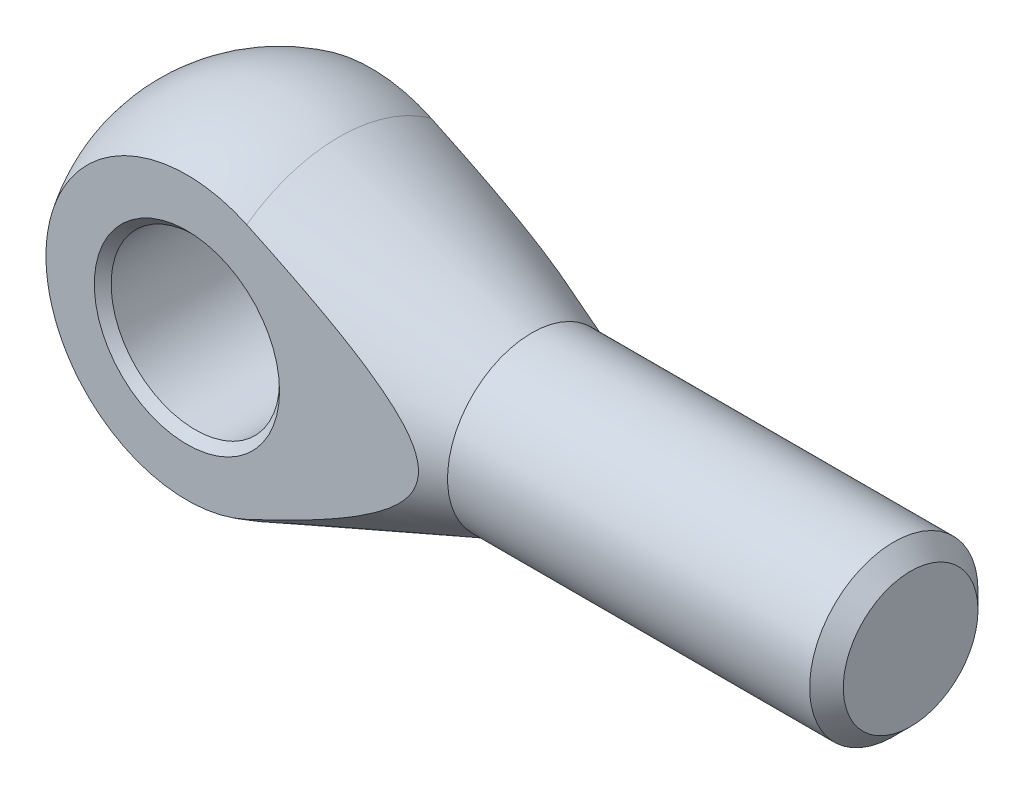
ISO-10303-21;
HEADER;
FILE_DESCRIPTION(('STEP AP214'),'2;1');
FILE_NAME('part.step','',(''),(''),'','','');
FILE_SCHEMA(('AUTOMOTIVE_DESIGN { 1 0 10303 214 1 1 1 1 }'));
ENDSEC;
DATA;
#1=APPLICATION_CONTEXT('core data for automotive mechanical design processes');
#2=APPLICATION_PROTOCOL_DEFINITION('international standard','automotive_design',2000,#1);
#3=PRODUCT_CONTEXT('',#1,'mechanical');
#4=PRODUCT('Part','Part','',(#3));
#5=PRODUCT_RELATED_PRODUCT_CATEGORY('part','',(#4));
#6=PRODUCT_DEFINITION_FORMATION('','',#4);
#7=PRODUCT_DEFINITION_CONTEXT('part definition',#1,'design');
#8=PRODUCT_DEFINITION('design','',#6,#7);
#9=PRODUCT_DEFINITION_SHAPE('','',#8);
#10=(LENGTH_UNIT() NAMED_UNIT(*) SI_UNIT(.MILLI.,.METRE.));
#11=(NAMED_UNIT(*) PLANE_ANGLE_UNIT() SI_UNIT($,.RADIAN.));
#12=(NAMED_UNIT(*) SI_UNIT($,.STERADIAN.) SOLID_ANGLE_UNIT());
#13=UNCERTAINTY_MEASURE_WITH_UNIT(LENGTH_MEASURE(1.E-05),#10,'distance_accuracy_value','');
#14=(GEOMETRIC_REPRESENTATION_CONTEXT(3) GLOBAL_UNCERTAINTY_ASSIGNED_CONTEXT((#13)) GLOBAL_UNIT_ASSIGNED_CONTEXT((#10,
#11,#12)) REPRESENTATION_CONTEXT('',''));
#15=CARTESIAN_POINT('',(0.,0.,0.));
#16=DIRECTION('',(0.,0.,1.));
#17=DIRECTION('',(1.,0.,0.));
#18=AXIS2_PLACEMENT_3D('',#15,#16,#17);
#19=CARTESIAN_POINT('',(0.,0.,0.));
#20=DIRECTION('',(1.,0.,0.));
#21=DIRECTION('',(0.,1.,0.));
#22=AXIS2_PLACEMENT_3D('',#19,#20,#21);
#23=SPHERICAL_SURFACE('',#22,20.);
#24=CARTESIAN_POINT('',(7.10102051443364,0.,0.));
#25=DIRECTION('',(1.,0.,0.));
#26=DIRECTION('',(0.,0.,-1.));
#27=AXIS2_PLACEMENT_3D('',#24,#25,#26);
#28=CIRCLE('',#27,18.6969384566991);
#29=CARTESIAN_POINT('',(7.10102051443364,15.1549664352513,-10.95));
#30=VERTEX_POINT('',#29);
#31=CARTESIAN_POINT('',(7.10102051443364,15.1549664352513,10.95));
#32=VERTEX_POINT('',#31);
#33=EDGE_CURVE('E79',#30,#32,#28,.T.);
#34=ORIENTED_EDGE('',*,*,#33,.F.);
#35=CARTESIAN_POINT('',(0.,0.,-10.95));
#36=DIRECTION('',(0.,0.,-1.));
#37=DIRECTION('',(-1.,0.,0.));
#38=AXIS2_PLACEMENT_3D('',#35,#36,#37);
#39=CIRCLE('',#38,16.7361136468417);
#40=CARTESIAN_POINT('',(7.10102051443364,-15.1549664352513,-10.95));
#41=VERTEX_POINT('',#40);
#42=EDGE_CURVE('E63',#30,#41,#39,.F.);
#43=ORIENTED_EDGE('',*,*,#42,.T.);
#44=CARTESIAN_POINT('',(7.10102051443364,-15.1549664352513,10.95));
#45=VERTEX_POINT('',#44);
#46=EDGE_CURVE('E80',#45,#41,#28,.T.);
#47=ORIENTED_EDGE('',*,*,#46,.F.);
#48=CARTESIAN_POINT('',(0.,0.,10.95));
#49=DIRECTION('',(0.,0.,1.));
#50=DIRECTION('',(1.,0.,0.));
#51=AXIS2_PLACEMENT_3D('',#48,#49,#50);
#52=CIRCLE('',#51,16.7361136468417);
#53=EDGE_CURVE('E56',#45,#32,#52,.F.);
#54=ORIENTED_EDGE('',*,*,#53,.T.);
#55=EDGE_LOOP('',(#34,#43,#47,#54));
#56=FACE_BOUND('',#55,.T.);
#57=ADVANCED_FACE('F41',(#56),#23,.T.);
#58=CARTESIAN_POINT('',(30.,0.,0.));
#59=DIRECTION('',(-1.,0.,0.));
#60=DIRECTION('',(0.,0.,1.));
#61=AXIS2_PLACEMENT_3D('',#58,#59,#60);
#62=CONICAL_SURFACE('',#61,10.,0.362968648605641);
#63=CARTESIAN_POINT('',(30.,0.,0.));
#64=DIRECTION('',(1.,0.,0.));
#65=DIRECTION('',(0.,0.,-1.));
#66=AXIS2_PLACEMENT_3D('',#63,#64,#65);
#67=CIRCLE('',#66,10.);
#68=CARTESIAN_POINT('',(30.,0.,-10.));
#69=VERTEX_POINT('',#68);
#70=EDGE_CURVE('E75',#69,#69,#67,.T.);
#71=ORIENTED_EDGE('',*,*,#70,.F.);
#72=EDGE_LOOP('',(#71));
#73=FACE_BOUND('',#72,.T.);
#74=ORIENTED_EDGE('',*,*,#46,.T.);
#75=CARTESIAN_POINT('',(-36.7473868844414,-33.6117111502292,-10.95));
#76=CARTESIAN_POINT('',(-35.7417349593616,-33.2100087233071,-10.95));
#77=CARTESIAN_POINT('',(-34.7363189988211,-32.8077157218094,-10.95));
#78=CARTESIAN_POINT('',(-32.7260191972657,-32.0018003338569,-10.95));
#79=CARTESIAN_POINT('',(-31.7211353566434,-31.5981779464226,-10.95));
#80=CARTESIAN_POINT('',(-28.7073130348301,-30.3850704903985,-10.95));
#81=CARTESIAN_POINT('',(-26.6992653148223,-29.5733696972676,-10.95));
#82=CARTESIAN_POINT('',(-22.6835120174359,-27.9413836796302,-10.95));
#83=CARTESIAN_POINT('',(-20.6758105339449,-27.1210883762279,-10.95));
#84=CARTESIAN_POINT('',(-16.6644433904571,-25.4707916822328,-10.95));
#85=CARTESIAN_POINT('',(-14.6607776442459,-24.6407905016179,-10.95));
#86=CARTESIAN_POINT('',(-11.652620103579,-23.3832101454071,-10.95));
#87=CARTESIAN_POINT('',(-10.6460970205411,-22.9604894420974,-10.95));
#88=CARTESIAN_POINT('',(-8.63469121112859,-22.111164879417,-10.95));
#89=CARTESIAN_POINT('',(-7.62980848216991,-21.6845610261705,-10.95));
#90=CARTESIAN_POINT('',(-5.62193345648905,-20.8267363544043,-10.95));
#91=CARTESIAN_POINT('',(-4.61894129294301,-20.3955152239482,-10.95));
#92=CARTESIAN_POINT('',(-2.61533602472811,-19.5275832192706,-10.95));
#93=CARTESIAN_POINT('',(-1.61472291347419,-19.0908723602655,-10.95));
#94=CARTESIAN_POINT('',(0.382913644239469,-18.2110855033613,-10.95));
#95=CARTESIAN_POINT('',(1.37993902843663,-17.7680139102391,-10.95));
#96=CARTESIAN_POINT('',(3.37033269066245,-16.8736823235612,-10.95));
#97=CARTESIAN_POINT('',(4.36370092156579,-16.4224222249312,-10.95));
#98=CARTESIAN_POINT('',(6.34559948082244,-15.5096901384702,-10.95));
#99=CARTESIAN_POINT('',(7.33413036725252,-15.0482193642475,-10.95));
#100=CARTESIAN_POINT('',(9.30494471143385,-14.1121476710677,-10.95));
#101=CARTESIAN_POINT('',(10.287228385113,-13.6375472089903,-10.95));
#102=CARTESIAN_POINT('',(11.6969691534924,-12.9408840332531,-10.95));
#103=CARTESIAN_POINT('',(12.1278888460484,-12.7258235280497,-10.95));
#104=CARTESIAN_POINT('',(12.9877648924916,-12.2917992901895,-10.95));
#105=CARTESIAN_POINT('',(13.4167212318223,-12.0728355286525,-10.95));
#106=CARTESIAN_POINT('',(14.2724462389769,-11.6303521918964,-10.95));
#107=CARTESIAN_POINT('',(14.6992142001016,-11.4068312483256,-10.95));
#108=CARTESIAN_POINT('',(15.5499748875007,-10.954567840359,-10.95));
#109=CARTESIAN_POINT('',(15.9739676335654,-10.7258254132507,-10.95));
#110=CARTESIAN_POINT('',(16.8200740591547,-10.2613939787212,-10.95));
#111=CARTESIAN_POINT('',(17.242175936597,-10.0256834257222,-10.95));
#112=CARTESIAN_POINT('',(18.0821937590202,-9.54692360155704,-10.95));
#113=CARTESIAN_POINT('',(18.500109804056,-9.30387450636589,-10.95));
#114=CARTESIAN_POINT('',(19.3304799028364,-8.80904725841947,-10.95));
#115=CARTESIAN_POINT('',(19.7429365718982,-8.55727351103915,-10.95));
#116=CARTESIAN_POINT('',(20.5610241312773,-8.0429223185966,-10.95));
#117=CARTESIAN_POINT('',(20.9666556664335,-7.78034590233843,-10.95));
#118=CARTESIAN_POINT('',(21.7720503819625,-7.23960258445816,-10.95));
#119=CARTESIAN_POINT('',(22.1717437135398,-6.9613306220719,-10.95));
#120=CARTESIAN_POINT('',(22.7618733866236,-6.53067505376457,-10.95));
#121=CARTESIAN_POINT('',(22.9570986234064,-6.38484825046697,-10.95));
#122=CARTESIAN_POINT('',(23.3436910460863,-6.08817719819511,-10.95));
#123=CARTESIAN_POINT('',(23.5350584986272,-5.93733329791745,-10.95));
#124=CARTESIAN_POINT('',(23.9120415169794,-5.630770862365,-10.95));
#125=CARTESIAN_POINT('',(24.0976837876929,-5.47508526660818,-10.95));
#126=CARTESIAN_POINT('',(24.4632614250757,-5.15717583081847,-10.95));
#127=CARTESIAN_POINT('',(24.6431976252502,-4.99495295364305,-10.95));
#128=CARTESIAN_POINT('',(24.995728664026,-4.66313643223942,-10.95));
#129=CARTESIAN_POINT('',(25.1683327988046,-4.49355270824338,-10.95));
#130=CARTESIAN_POINT('',(25.5044679715233,-4.14566626307246,-10.95));
#131=CARTESIAN_POINT('',(25.6680025424362,-3.96736698861799,-10.95));
#132=CARTESIAN_POINT('',(25.9312199338345,-3.66128628131261,-10.95));
#133=CARTESIAN_POINT('',(26.0341390287964,-3.5362901696311,-10.95));
#134=CARTESIAN_POINT('',(26.2336790845882,-3.28133090419109,-10.95));
#135=CARTESIAN_POINT('',(26.3302995990424,-3.15136739943036,-10.95));
#136=CARTESIAN_POINT('',(26.5159738348143,-2.88602358056452,-10.95));
#137=CARTESIAN_POINT('',(26.6050248504388,-2.7506413547767,-10.95));
#138=CARTESIAN_POINT('',(26.773892011185,-2.47429160016427,-10.95));
#139=CARTESIAN_POINT('',(26.8537094047162,-2.33332482985232,-10.95));
#140=CARTESIAN_POINT('',(27.0546611626469,-1.94398775658876,-10.95));
#141=CARTESIAN_POINT('',(27.1653037907263,-1.68989652496241,-10.95));
#142=CARTESIAN_POINT('',(27.2987988283431,-1.29803225675869,-10.95));
#143=CARTESIAN_POINT('',(27.3378755468031,-1.16568400184324,-10.95));
#144=CARTESIAN_POINT('',(27.4039807051444,-0.89803872137714,-10.95));
#145=CARTESIAN_POINT('',(27.4310160843652,-0.762743441456954,-10.95));
#146=CARTESIAN_POINT('',(27.472227697509,-0.488705913790881,-10.95));
#147=CARTESIAN_POINT('',(27.4862628016695,-0.349942255463342,-10.95));
#148=CARTESIAN_POINT('',(27.500363811325,-0.0717033778222943,-10.95));
#149=CARTESIAN_POINT('',(27.5004302797607,0.0677718125896997,-10.95));
#150=CARTESIAN_POINT('',(27.4865857143661,0.34612016265784,-10.95));
#151=CARTESIAN_POINT('',(27.4726646162149,0.484992816520053,-10.95));
#152=CARTESIAN_POINT('',(27.4314376993854,0.76072724290061,-10.95));
#153=CARTESIAN_POINT('',(27.4041302604318,0.897588769927307,-10.95));
#154=CARTESIAN_POINT('',(27.3340854850686,1.18085762309287,-10.95));
#155=CARTESIAN_POINT('',(27.2901478893058,1.32696674399089,-10.95));
#156=CARTESIAN_POINT('',(27.189306774172,1.61468037543159,-10.95));
#157=CARTESIAN_POINT('',(27.1323941695976,1.75628164999085,-10.95));
#158=CARTESIAN_POINT('',(26.9449108319188,2.17377369890062,-10.95));
#159=CARTESIAN_POINT('',(26.7976341442338,2.44220606848873,-10.95));
#160=CARTESIAN_POINT('',(26.4875701703933,2.93407515179227,-10.95));
#161=CARTESIAN_POINT('',(26.3276028915265,3.15936141832807,-10.95));
#162=CARTESIAN_POINT('',(25.9890096488689,3.5956500495048,-10.95));
#163=CARTESIAN_POINT('',(25.8103665830865,3.80663902512318,-10.95));
#164=CARTESIAN_POINT('',(25.4388061611562,4.21688715470743,-10.95));
#165=CARTESIAN_POINT('',(25.2458398927565,4.41610151003149,-10.95));
#166=CARTESIAN_POINT('',(24.9487233221588,4.70690853217967,-10.95));
#167=CARTESIAN_POINT('',(24.8484269661759,4.80249054619742,-10.95));
#168=CARTESIAN_POINT('',(24.6455666765239,4.99121797099733,-10.95));
#169=CARTESIAN_POINT('',(24.5430027553168,5.08436339516436,-10.95));
#170=CARTESIAN_POINT('',(24.2397302010473,5.35387397638968,-10.95));
#171=CARTESIAN_POINT('',(24.036319825678,5.52720294589202,-10.95));
#172=CARTESIAN_POINT('',(23.6236508754012,5.86677732865278,-10.95));
#173=CARTESIAN_POINT('',(23.4143913349643,6.0330215608529,-10.95));
#174=CARTESIAN_POINT('',(22.9910513173421,6.35949535205868,-10.95));
#175=CARTESIAN_POINT('',(22.7769681363007,6.5197213963026,-10.95));
#176=CARTESIAN_POINT('',(22.3449329120949,6.83488007897036,-10.95));
#177=CARTESIAN_POINT('',(22.1269806204287,6.98981237550938,-10.95));
#178=CARTESIAN_POINT('',(21.4673808373102,7.44837603999358,-10.95));
#179=CARTESIAN_POINT('',(21.0209112441708,7.74507506060749,-10.95));
#180=CARTESIAN_POINT('',(20.1188100878175,8.3242010904481,-10.95));
#181=CARTESIAN_POINT('',(19.6631773569182,8.60662626439929,-10.95));
#182=CARTESIAN_POINT('',(18.9724610232141,9.02300492631211,-10.95));
#183=CARTESIAN_POINT('',(18.7399237596162,9.16120701213973,-10.95));
#184=CARTESIAN_POINT('',(18.2733332431445,9.43498757849716,-10.95));
#185=CARTESIAN_POINT('',(18.039280105104,9.5705662547279,-10.95));
#186=CARTESIAN_POINT('',(17.3350620874899,9.97380851664276,-10.95));
#187=CARTESIAN_POINT('',(16.8628806460893,10.2379531332268,-10.95));
#188=CARTESIAN_POINT('',(15.9150581516269,10.7581044356187,-10.95));
#189=CARTESIAN_POINT('',(15.4394238630782,11.0141234957463,-10.95));
#190=CARTESIAN_POINT('',(14.4847699564358,11.5197188561084,-10.95));
#191=CARTESIAN_POINT('',(14.0057504585289,11.7692953836263,-10.95));
#192=CARTESIAN_POINT('',(12.9981112885397,12.2870580221872,-10.95));
#193=CARTESIAN_POINT('',(12.4692063019445,12.5546880734431,-10.95));
#194=CARTESIAN_POINT('',(11.4086347917533,13.0844262053535,-10.95));
#195=CARTESIAN_POINT('',(10.8769682353802,13.3465342202795,-10.95));
#196=CARTESIAN_POINT('',(9.81131283657439,13.8660531072913,-10.95));
#197=CARTESIAN_POINT('',(9.27732387293425,14.1234637304854,-10.95));
#198=CARTESIAN_POINT('',(8.20740630777343,14.6342247858855,-10.95));
#199=CARTESIAN_POINT('',(7.67147769513067,14.8875751947647,-10.95));
#200=CARTESIAN_POINT('',(6.06100943113129,15.6424611746169,-10.95));
#201=CARTESIAN_POINT('',(4.98399968103445,16.1387285643732,-10.95));
#202=CARTESIAN_POINT('',(2.82506938339129,17.1204631578094,-10.95));
#203=CARTESIAN_POINT('',(1.74314877747543,17.605930232712,-10.95));
#204=CARTESIAN_POINT('',(0.116570996183445,18.3280816448888,-10.95));
#205=CARTESIAN_POINT('',(-0.426664227899643,18.5679759046434,-10.95));
#206=CARTESIAN_POINT('',(-1.51397986348038,19.0458304945214,-10.95));
#207=CARTESIAN_POINT('',(-2.0580602687461,19.2837908388247,-10.95));
#208=CARTESIAN_POINT('',(-3.69144165744208,19.9950782157829,-10.95));
#209=CARTESIAN_POINT('',(-4.78187411052375,20.4658077364439,-10.95));
#210=CARTESIAN_POINT('',(-6.96502236343918,21.4015389530705,-10.95));
#211=CARTESIAN_POINT('',(-8.0577378474023,21.8665413870241,-10.95));
#212=CARTESIAN_POINT('',(-10.2451640600059,22.791830118973,-10.95));
#213=CARTESIAN_POINT('',(-11.3398747912174,23.2521164108862,-10.95));
#214=CARTESIAN_POINT('',(-14.4560329541505,24.5557492331203,-10.95));
#215=CARTESIAN_POINT('',(-16.4794626912536,25.3943569244172,-10.95));
#216=CARTESIAN_POINT('',(-20.5305051617139,27.0616145709659,-10.95));
#217=CARTESIAN_POINT('',(-22.558118056098,27.8902641341801,-10.95));
#218=CARTESIAN_POINT('',(-26.6113591628902,29.5377964173734,-10.95));
#219=CARTESIAN_POINT('',(-28.6369795196071,30.3566984745872,-10.95));
#220=CARTESIAN_POINT('',(-31.6771769022293,31.5805135935852,-10.95));
#221=CARTESIAN_POINT('',(-32.6908456810704,31.9876857319123,-10.95));
#222=CARTESIAN_POINT('',(-34.7187252449435,32.8006759147025,-10.95));
#223=CARTESIAN_POINT('',(-35.7329360295612,33.2064939601989,-10.95));
#224=CARTESIAN_POINT('',(-36.7473868844414,33.6117111502292,-10.95));
#225=B_SPLINE_CURVE_WITH_KNOTS('',3,(#75,#76,#77,#78,#79,#80,#81,#82,#83,#84,#85,#86,#87,#88,
#89,#90,#91,#92,#93,#94,#95,#96,#97,#98,#99,#100,#101,#102,#103,#104,#105,#106,#107,#108,#109,
#110,#111,#112,#113,#114,#115,#116,#117,#118,#119,#120,#121,#122,#123,#124,#125,#126,#127,#128,
#129,#130,#131,#132,#133,#134,#135,#136,#137,#138,#139,#140,#141,#142,#143,#144,#145,#146,#147,
#148,#149,#150,#151,#152,#153,#154,#155,#156,#157,#158,#159,#160,#161,#162,#163,#164,#165,#166,
#167,#168,#169,#170,#171,#172,#173,#174,#175,#176,#177,#178,#179,#180,#181,#182,#183,#184,#185,
#186,#187,#188,#189,#190,#191,#192,#193,#194,#195,#196,#197,#198,#199,#200,#201,#202,#203,#204,
#205,#206,#207,#208,#209,#210,#211,#212,#213,#214,#215,#216,#217,#218,#219,#220,#221,#222,#223,
#224),.UNSPECIFIED.,.F.,.F.,(4,2,2,2,2,2,2,2,2,2,2,2,2,2,2,2,2,2,2,2,2,2,2,2,2,2,2,2,2,2,2,2,2,
2,2,2,2,2,2,2,2,2,2,2,2,2,2,2,2,2,2,2,2,2,2,2,2,2,2,2,2,2,2,2,2,2,2,2,2,2,2,2,2,2,4),(0.,
3.24873867555936,6.49747974518948,12.9951607323639,19.5015823416852,26.007863449845,
29.2829194521491,32.5579702901448,35.8332437995588,39.1085082326271,42.3816045967868,
45.6547429908025,48.9274944178938,52.2001321044556,53.64492976606,55.0897381222216,
56.5349868828041,57.9802253258489,59.4305314720912,60.8808028681897,62.3303523480678,
63.7797640966289,65.2404094780302,65.9713749950522,66.7022898144808,67.429010381264,
68.1556242998897,68.881287646476,69.6066663022981,70.092244917844,70.5778579086499,
71.0636437566711,71.5493638482422,72.3771682641806,72.7907038270207,73.2040007628756,
73.6217335579651,74.039449518283,74.4574662485828,74.8755335878936,75.3325402189688,
75.7898678379036,76.7049729710382,77.5327790155381,78.3613498600875,79.1928933555429,
79.6085025887214,80.0241095383608,80.8256255917729,81.6272747430608,82.4293850183087,
83.2315469985102,84.8393362776209,86.4473317568204,87.258834487682,88.0702764468997,
89.6933073866292,91.3137348345805,92.9341050377958,94.7123511557926,96.4906184282428,
98.2689796503821,100.047351085964,103.6048017838,107.162294876148,108.94383140567,
110.725354860831,114.288430328239,117.851041752989,121.4136577717,127.984596899439,
134.55579387387,141.110446653136,144.387612680272,147.664776205967),.UNSPECIFIED.);
#226=EDGE_CURVE('E74',#41,#30,#225,.T.);
#227=ORIENTED_EDGE('',*,*,#226,.T.);
#228=ORIENTED_EDGE('',*,*,#33,.T.);
#229=CARTESIAN_POINT('',(-36.7473868844414,33.6117111502292,10.95));
#230=CARTESIAN_POINT('',(-35.7417349593616,33.2100087233071,10.95));
#231=CARTESIAN_POINT('',(-34.7363189988211,32.8077157218094,10.95));
#232=CARTESIAN_POINT('',(-32.7260191972657,32.0018003338569,10.95));
#233=CARTESIAN_POINT('',(-31.7211353566434,31.5981779464226,10.95));
#234=CARTESIAN_POINT('',(-28.7073130348301,30.3850704903985,10.95));
#235=CARTESIAN_POINT('',(-26.6992653148223,29.5733696972676,10.95));
#236=CARTESIAN_POINT('',(-22.6835120174359,27.9413836796302,10.95));
#237=CARTESIAN_POINT('',(-20.6758105339449,27.1210883762279,10.95));
#238=CARTESIAN_POINT('',(-16.6644433904571,25.4707916822328,10.95));
#239=CARTESIAN_POINT('',(-14.6607776442459,24.6407905016179,10.95));
#240=CARTESIAN_POINT('',(-11.652620103579,23.3832101454071,10.95));
#241=CARTESIAN_POINT('',(-10.6460970205411,22.9604894420974,10.95));
#242=CARTESIAN_POINT('',(-8.63469121112859,22.111164879417,10.95));
#243=CARTESIAN_POINT('',(-7.62980848216991,21.6845610261705,10.95));
#244=CARTESIAN_POINT('',(-5.62193345648905,20.8267363544043,10.95));
#245=CARTESIAN_POINT('',(-4.61894129294301,20.3955152239482,10.95));
#246=CARTESIAN_POINT('',(-2.61533602472811,19.5275832192706,10.95));
#247=CARTESIAN_POINT('',(-1.61472291347419,19.0908723602655,10.95));
#248=CARTESIAN_POINT('',(0.382913644239469,18.2110855033613,10.95));
#249=CARTESIAN_POINT('',(1.37993902843663,17.7680139102391,10.95));
#250=CARTESIAN_POINT('',(3.37033269066245,16.8736823235612,10.95));
#251=CARTESIAN_POINT('',(4.36370092156579,16.4224222249312,10.95));
#252=CARTESIAN_POINT('',(6.34559948082244,15.5096901384702,10.95));
#253=CARTESIAN_POINT('',(7.33413036725252,15.0482193642475,10.95));
#254=CARTESIAN_POINT('',(9.30494471143385,14.1121476710677,10.95));
#255=CARTESIAN_POINT('',(10.287228385113,13.6375472089903,10.95));
#256=CARTESIAN_POINT('',(11.6969691534924,12.9408840332531,10.95));
#257=CARTESIAN_POINT('',(12.1278888460484,12.7258235280497,10.95));
#258=CARTESIAN_POINT('',(12.9877648924916,12.2917992901895,10.95));
#259=CARTESIAN_POINT('',(13.4167212318223,12.0728355286525,10.95));
#260=CARTESIAN_POINT('',(14.2724462389769,11.6303521918964,10.95));
#261=CARTESIAN_POINT('',(14.6992142001016,11.4068312483256,10.95));
#262=CARTESIAN_POINT('',(15.5499748875007,10.954567840359,10.95));
#263=CARTESIAN_POINT('',(15.9739676335654,10.7258254132507,10.95));
#264=CARTESIAN_POINT('',(16.8200740591547,10.2613939787212,10.95));
#265=CARTESIAN_POINT('',(17.242175936597,10.0256834257222,10.95));
#266=CARTESIAN_POINT('',(18.0821937590202,9.54692360155704,10.95));
#267=CARTESIAN_POINT('',(18.500109804056,9.30387450636589,10.95));
#268=CARTESIAN_POINT('',(19.3304799028364,8.80904725841947,10.95));
#269=CARTESIAN_POINT('',(19.7429365718982,8.55727351103915,10.95));
#270=CARTESIAN_POINT('',(20.5610241312773,8.0429223185966,10.95));
#271=CARTESIAN_POINT('',(20.9666556664335,7.78034590233843,10.95));
#272=CARTESIAN_POINT('',(21.7720503819625,7.23960258445816,10.95));
#273=CARTESIAN_POINT('',(22.1717437135398,6.9613306220719,10.95));
#274=CARTESIAN_POINT('',(22.7618733866236,6.53067505376457,10.95));
#275=CARTESIAN_POINT('',(22.9570986234064,6.38484825046697,10.95));
#276=CARTESIAN_POINT('',(23.3436910460863,6.08817719819511,10.95));
#277=CARTESIAN_POINT('',(23.5350584986272,5.93733329791745,10.95));
#278=CARTESIAN_POINT('',(23.9120415169794,5.630770862365,10.95));
#279=CARTESIAN_POINT('',(24.0976837876929,5.47508526660818,10.95));
#280=CARTESIAN_POINT('',(24.4632614250757,5.15717583081847,10.95));
#281=CARTESIAN_POINT('',(24.6431976252502,4.99495295364305,10.95));
#282=CARTESIAN_POINT('',(24.995728664026,4.66313643223942,10.95));
#283=CARTESIAN_POINT('',(25.1683327988046,4.49355270824338,10.95));
#284=CARTESIAN_POINT('',(25.5044679715233,4.14566626307246,10.95));
#285=CARTESIAN_POINT('',(25.6680025424362,3.96736698861799,10.95));
#286=CARTESIAN_POINT('',(25.9312199338345,3.66128628131261,10.95));
#287=CARTESIAN_POINT('',(26.0341390287964,3.5362901696311,10.95));
#288=CARTESIAN_POINT('',(26.2336790845882,3.28133090419109,10.95));
#289=CARTESIAN_POINT('',(26.3302995990424,3.15136739943036,10.95));
#290=CARTESIAN_POINT('',(26.5159738348143,2.88602358056452,10.95));
#291=CARTESIAN_POINT('',(26.6050248504388,2.7506413547767,10.95));
#292=CARTESIAN_POINT('',(26.773892011185,2.47429160016427,10.95));
#293=CARTESIAN_POINT('',(26.8537094047162,2.33332482985232,10.95));
#294=CARTESIAN_POINT('',(27.0546611626469,1.94398775658876,10.95));
#295=CARTESIAN_POINT('',(27.1653037907263,1.68989652496241,10.95));
#296=CARTESIAN_POINT('',(27.2987988283431,1.29803225675869,10.95));
#297=CARTESIAN_POINT('',(27.3378755468031,1.16568400184324,10.95));
#298=CARTESIAN_POINT('',(27.4039807051444,0.89803872137714,10.95));
#299=CARTESIAN_POINT('',(27.4310160843652,0.762743441456954,10.95));
#300=CARTESIAN_POINT('',(27.472227697509,0.488705913790881,10.95));
#301=CARTESIAN_POINT('',(27.4862628016695,0.349942255463342,10.95));
#302=CARTESIAN_POINT('',(27.500363811325,0.0717033778222943,10.95));
#303=CARTESIAN_POINT('',(27.5004302797607,-0.0677718125896997,10.95));
#304=CARTESIAN_POINT('',(27.4865857143661,-0.34612016265784,10.95));
#305=CARTESIAN_POINT('',(27.4726646162149,-0.484992816520053,10.95));
#306=CARTESIAN_POINT('',(27.4314376993854,-0.76072724290061,10.95));
#307=CARTESIAN_POINT('',(27.4041302604318,-0.897588769927307,10.95));
#308=CARTESIAN_POINT('',(27.3340854850686,-1.18085762309287,10.95));
#309=CARTESIAN_POINT('',(27.2901478893058,-1.32696674399089,10.95));
#310=CARTESIAN_POINT('',(27.189306774172,-1.61468037543159,10.95));
#311=CARTESIAN_POINT('',(27.1323941695976,-1.75628164999085,10.95));
#312=CARTESIAN_POINT('',(26.9449108319188,-2.17377369890062,10.95));
#313=CARTESIAN_POINT('',(26.7976341442338,-2.44220606848873,10.95));
#314=CARTESIAN_POINT('',(26.4875701703933,-2.93407515179227,10.95));
#315=CARTESIAN_POINT('',(26.3276028915265,-3.15936141832807,10.95));
#316=CARTESIAN_POINT('',(25.9890096488689,-3.5956500495048,10.95));
#317=CARTESIAN_POINT('',(25.8103665830865,-3.80663902512318,10.95));
#318=CARTESIAN_POINT('',(25.4388061611562,-4.21688715470743,10.95));
#319=CARTESIAN_POINT('',(25.2458398927565,-4.41610151003149,10.95));
#320=CARTESIAN_POINT('',(24.9487233221588,-4.70690853217967,10.95));
#321=CARTESIAN_POINT('',(24.8484269661759,-4.80249054619742,10.95));
#322=CARTESIAN_POINT('',(24.6455666765239,-4.99121797099733,10.95));
#323=CARTESIAN_POINT('',(24.5430027553168,-5.08436339516436,10.95));
#324=CARTESIAN_POINT('',(24.2397302010473,-5.35387397638968,10.95));
#325=CARTESIAN_POINT('',(24.036319825678,-5.52720294589202,10.95));
#326=CARTESIAN_POINT('',(23.6236508754012,-5.86677732865278,10.95));
#327=CARTESIAN_POINT('',(23.4143913349643,-6.0330215608529,10.95));
#328=CARTESIAN_POINT('',(22.9910513173421,-6.35949535205868,10.95));
#329=CARTESIAN_POINT('',(22.7769681363007,-6.5197213963026,10.95));
#330=CARTESIAN_POINT('',(22.3449329120949,-6.83488007897036,10.95));
#331=CARTESIAN_POINT('',(22.1269806204287,-6.98981237550938,10.95));
#332=CARTESIAN_POINT('',(21.4673808373102,-7.44837603999358,10.95));
#333=CARTESIAN_POINT('',(21.0209112441708,-7.74507506060749,10.95));
#334=CARTESIAN_POINT('',(20.1188100878175,-8.3242010904481,10.95));
#335=CARTESIAN_POINT('',(19.6631773569182,-8.60662626439929,10.95));
#336=CARTESIAN_POINT('',(18.9724610232141,-9.02300492631211,10.95));
#337=CARTESIAN_POINT('',(18.7399237596162,-9.16120701213973,10.95));
#338=CARTESIAN_POINT('',(18.2733332431445,-9.43498757849716,10.95));
#339=CARTESIAN_POINT('',(18.039280105104,-9.5705662547279,10.95));
#340=CARTESIAN_POINT('',(17.3350620874899,-9.97380851664276,10.95));
#341=CARTESIAN_POINT('',(16.8628806460893,-10.2379531332268,10.95));
#342=CARTESIAN_POINT('',(15.9150581516269,-10.7581044356187,10.95));
#343=CARTESIAN_POINT('',(15.4394238630782,-11.0141234957463,10.95));
#344=CARTESIAN_POINT('',(14.4847699564358,-11.5197188561084,10.95));
#345=CARTESIAN_POINT('',(14.0057504585289,-11.7692953836263,10.95));
#346=CARTESIAN_POINT('',(12.9981112885397,-12.2870580221872,10.95));
#347=CARTESIAN_POINT('',(12.4692063019445,-12.5546880734431,10.95));
#348=CARTESIAN_POINT('',(11.4086347917533,-13.0844262053535,10.95));
#349=CARTESIAN_POINT('',(10.8769682353802,-13.3465342202795,10.95));
#350=CARTESIAN_POINT('',(9.81131283657439,-13.8660531072913,10.95));
#351=CARTESIAN_POINT('',(9.27732387293425,-14.1234637304854,10.95));
#352=CARTESIAN_POINT('',(8.20740630777343,-14.6342247858855,10.95));
#353=CARTESIAN_POINT('',(7.67147769513067,-14.8875751947647,10.95));
#354=CARTESIAN_POINT('',(6.06100943113129,-15.6424611746169,10.95));
#355=CARTESIAN_POINT('',(4.98399968103445,-16.1387285643732,10.95));
#356=CARTESIAN_POINT('',(2.82506938339129,-17.1204631578094,10.95));
#357=CARTESIAN_POINT('',(1.74314877747543,-17.605930232712,10.95));
#358=CARTESIAN_POINT('',(0.116570996183445,-18.3280816448888,10.95));
#359=CARTESIAN_POINT('',(-0.426664227899643,-18.5679759046434,10.95));
#360=CARTESIAN_POINT('',(-1.51397986348038,-19.0458304945214,10.95));
#361=CARTESIAN_POINT('',(-2.0580602687461,-19.2837908388247,10.95));
#362=CARTESIAN_POINT('',(-3.69144165744208,-19.9950782157829,10.95));
#363=CARTESIAN_POINT('',(-4.78187411052375,-20.4658077364439,10.95));
#364=CARTESIAN_POINT('',(-6.96502236343918,-21.4015389530705,10.95));
#365=CARTESIAN_POINT('',(-8.0577378474023,-21.8665413870241,10.95));
#366=CARTESIAN_POINT('',(-10.2451640600059,-22.791830118973,10.95));
#367=CARTESIAN_POINT('',(-11.3398747912174,-23.2521164108862,10.95));
#368=CARTESIAN_POINT('',(-14.4560329541505,-24.5557492331203,10.95));
#369=CARTESIAN_POINT('',(-16.4794626912536,-25.3943569244172,10.95));
#370=CARTESIAN_POINT('',(-20.5305051617139,-27.0616145709659,10.95));
#371=CARTESIAN_POINT('',(-22.558118056098,-27.8902641341801,10.95));
#372=CARTESIAN_POINT('',(-26.6113591628902,-29.5377964173734,10.95));
#373=CARTESIAN_POINT('',(-28.6369795196071,-30.3566984745872,10.95));
#374=CARTESIAN_POINT('',(-31.6771769022293,-31.5805135935852,10.95));
#375=CARTESIAN_POINT('',(-32.6908456810704,-31.9876857319123,10.95));
#376=CARTESIAN_POINT('',(-34.7187252449435,-32.8006759147025,10.95));
#377=CARTESIAN_POINT('',(-35.7329360295612,-33.2064939601989,10.95));
#378=CARTESIAN_POINT('',(-36.7473868844414,-33.6117111502292,10.95));
#379=B_SPLINE_CURVE_WITH_KNOTS('',3,(#229,#230,#231,#232,#233,#234,#235,#236,#237,#238,#239,
#240,#241,#242,#243,#244,#245,#246,#247,#248,#249,#250,#251,#252,#253,#254,#255,#256,#257,#258,
#259,#260,#261,#262,#263,#264,#265,#266,#267,#268,#269,#270,#271,#272,#273,#274,#275,#276,#277,
#278,#279,#280,#281,#282,#283,#284,#285,#286,#287,#288,#289,#290,#291,#292,#293,#294,#295,#296,
#297,#298,#299,#300,#301,#302,#303,#304,#305,#306,#307,#308,#309,#310,#311,#312,#313,#314,#315,
#316,#317,#318,#319,#320,#321,#322,#323,#324,#325,#326,#327,#328,#329,#330,#331,#332,#333,#334,
#335,#336,#337,#338,#339,#340,#341,#342,#343,#344,#345,#346,#347,#348,#349,#350,#351,#352,#353,
#354,#355,#356,#357,#358,#359,#360,#361,#362,#363,#364,#365,#366,#367,#368,#369,#370,#371,#372,
#373,#374,#375,#376,#377,#378),.UNSPECIFIED.,.F.,.F.,(4,2,2,2,2,2,2,2,2,2,2,2,2,2,2,2,2,2,2,2,2,
2,2,2,2,2,2,2,2,2,2,2,2,2,2,2,2,2,2,2,2,2,2,2,2,2,2,2,2,2,2,2,2,2,2,2,2,2,2,2,2,2,2,2,2,2,2,2,2,
2,2,2,2,2,4),(0.,3.24873867555936,6.49747974518948,12.9951607323639,19.5015823416852,
26.007863449845,29.2829194521491,32.5579702901448,35.8332437995588,39.1085082326271,
42.3816045967868,45.6547429908025,48.9274944178938,52.2001321044556,53.64492976606,
55.0897381222216,56.5349868828041,57.9802253258489,59.4305314720912,60.8808028681897,
62.3303523480678,63.7797640966289,65.2404094780302,65.9713749950522,66.7022898144808,
67.429010381264,68.1556242998897,68.881287646476,69.6066663022981,70.092244917844,
70.5778579086499,71.0636437566711,71.5493638482422,72.3771682641806,72.7907038270207,
73.2040007628756,73.6217335579651,74.039449518283,74.4574662485828,74.8755335878936,
75.3325402189688,75.7898678379036,76.7049729710382,77.5327790155381,78.3613498600875,
79.1928933555429,79.6085025887214,80.0241095383608,80.8256255917729,81.6272747430608,
82.4293850183087,83.2315469985102,84.8393362776209,86.4473317568204,87.258834487682,
88.0702764468997,89.6933073866292,91.3137348345805,92.9341050377958,94.7123511557926,
96.4906184282428,98.2689796503821,100.047351085964,103.6048017838,107.162294876148,
108.94383140567,110.725354860831,114.288430328239,117.851041752989,121.4136577717,
127.984596899439,134.55579387387,141.110446653136,144.387612680272,147.664776205967),.UNSPECIFIED.);
#380=EDGE_CURVE('E68',#32,#45,#379,.T.);
#381=ORIENTED_EDGE('',*,*,#380,.T.);
#382=EDGE_LOOP('',(#74,#227,#228,#381));
#383=FACE_BOUND('',#382,.T.);
#384=ADVANCED_FACE('F82',(#73,#383),#62,.T.);
#385=CARTESIAN_POINT('',(75.,10.,0.));
#386=DIRECTION('',(1.,0.,0.));
#387=DIRECTION('',(0.,0.,-1.));
#388=AXIS2_PLACEMENT_3D('',#385,#386,#387);
#389=PLANE('',#388);
#390=CARTESIAN_POINT('',(75.,0.,0.));
#391=DIRECTION('',(1.,0.,0.));
#392=DIRECTION('',(0.,0.,-1.));
#393=AXIS2_PLACEMENT_3D('',#390,#391,#392);
#394=CIRCLE('',#393,8.00000000000002);
#395=CARTESIAN_POINT('',(75.,0.,-8.00000000000002));
#396=VERTEX_POINT('',#395);
#397=EDGE_CURVE('E50',#396,#396,#394,.T.);
#398=ORIENTED_EDGE('',*,*,#397,.T.);
#399=EDGE_LOOP('',(#398));
#400=FACE_BOUND('',#399,.T.);
#401=ADVANCED_FACE('F128',(#400),#389,.T.);
#402=CARTESIAN_POINT('',(0.,0.,0.));
#403=DIRECTION('',(1.,0.,0.));
#404=DIRECTION('',(0.,0.,-1.));
#405=AXIS2_PLACEMENT_3D('',#402,#403,#404);
#406=CYLINDRICAL_SURFACE('',#405,10.);
#407=CARTESIAN_POINT('',(73.,0.,0.));
#408=DIRECTION('',(1.,0.,0.));
#409=DIRECTION('',(0.,0.,-1.));
#410=AXIS2_PLACEMENT_3D('',#407,#408,#409);
#411=CIRCLE('',#410,10.);
#412=CARTESIAN_POINT('',(73.,0.,-10.));
#413=VERTEX_POINT('',#412);
#414=EDGE_CURVE('E12',#413,#413,#411,.F.);
#415=ORIENTED_EDGE('',*,*,#414,.T.);
#416=EDGE_LOOP('',(#415));
#417=FACE_BOUND('',#416,.T.);
#418=ORIENTED_EDGE('',*,*,#70,.T.);
#419=EDGE_LOOP('',(#418));
#420=FACE_BOUND('',#419,.T.);
#421=ADVANCED_FACE('F105',(#417,#420),#406,.T.);
#422=CARTESIAN_POINT('',(-65.8108812473461,-20.,10.95));
#423=DIRECTION('',(0.,0.,1.));
#424=DIRECTION('',(1.,0.,0.));
#425=AXIS2_PLACEMENT_3D('',#422,#423,#424);
#426=PLANE('',#425);
#427=CARTESIAN_POINT('',(0.,0.,10.95));
#428=DIRECTION('',(0.,0.,1.));
#429=DIRECTION('',(1.,0.,0.));
#430=AXIS2_PLACEMENT_3D('',#427,#428,#429);
#431=CIRCLE('',#430,11.);
#432=CARTESIAN_POINT('',(11.,0.,10.95));
#433=VERTEX_POINT('',#432);
#434=EDGE_CURVE('E150',#433,#433,#431,.F.);
#435=ORIENTED_EDGE('',*,*,#434,.T.);
#436=EDGE_LOOP('',(#435));
#437=FACE_BOUND('',#436,.T.);
#438=ORIENTED_EDGE('',*,*,#380,.F.);
#439=ORIENTED_EDGE('',*,*,#53,.F.);
#440=EDGE_LOOP('',(#438,#439));
#441=FACE_BOUND('',#440,.T.);
#442=ADVANCED_FACE('F69',(#437,#441),#426,.T.);
#443=CARTESIAN_POINT('',(-65.8108812473461,-20.,-10.95));
#444=DIRECTION('',(0.,0.,-1.));
#445=DIRECTION('',(-1.,0.,0.));
#446=AXIS2_PLACEMENT_3D('',#443,#444,#445);
#447=PLANE('',#446);
#448=CARTESIAN_POINT('',(0.,0.,-10.95));
#449=DIRECTION('',(0.,0.,-1.));
#450=DIRECTION('',(-1.,0.,0.));
#451=AXIS2_PLACEMENT_3D('',#448,#449,#450);
#452=CIRCLE('',#451,11.);
#453=CARTESIAN_POINT('',(-11.,0.,-10.95));
#454=VERTEX_POINT('',#453);
#455=EDGE_CURVE('E149',#454,#454,#452,.F.);
#456=ORIENTED_EDGE('',*,*,#455,.T.);
#457=EDGE_LOOP('',(#456));
#458=FACE_BOUND('',#457,.T.);
#459=ORIENTED_EDGE('',*,*,#226,.F.);
#460=ORIENTED_EDGE('',*,*,#42,.F.);
#461=EDGE_LOOP('',(#459,#460));
#462=FACE_BOUND('',#461,.T.);
#463=ADVANCED_FACE('F104',(#458,#462),#447,.T.);
#464=CARTESIAN_POINT('',(0.,0.,-10.95));
#465=DIRECTION('',(0.,0.,1.));
#466=DIRECTION('',(1.,0.,0.));
#467=AXIS2_PLACEMENT_3D('',#464,#465,#466);
#468=CYLINDRICAL_SURFACE('',#467,10.);
#469=CARTESIAN_POINT('',(0.,0.,9.95000000000002));
#470=DIRECTION('',(0.,0.,1.));
#471=DIRECTION('',(1.,0.,0.));
#472=AXIS2_PLACEMENT_3D('',#469,#470,#471);
#473=CIRCLE('',#472,10.);
#474=CARTESIAN_POINT('',(10.,0.,9.95000000000002));
#475=VERTEX_POINT('',#474);
#476=EDGE_CURVE('E154',#475,#475,#473,.T.);
#477=ORIENTED_EDGE('',*,*,#476,.T.);
#478=EDGE_LOOP('',(#477));
#479=FACE_BOUND('',#478,.T.);
#480=CARTESIAN_POINT('',(0.,0.,-9.94999999999998));
#481=DIRECTION('',(0.,0.,-1.));
#482=DIRECTION('',(-1.,0.,0.));
#483=AXIS2_PLACEMENT_3D('',#480,#481,#482);
#484=CIRCLE('',#483,10.);
#485=CARTESIAN_POINT('',(-10.,0.,-9.94999999999998));
#486=VERTEX_POINT('',#485);
#487=EDGE_CURVE('E146',#486,#486,#484,.T.);
#488=ORIENTED_EDGE('',*,*,#487,.T.);
#489=EDGE_LOOP('',(#488));
#490=FACE_BOUND('',#489,.T.);
#491=ADVANCED_FACE('F110',(#479,#490),#468,.F.);
#492=CARTESIAN_POINT('',(0.,0.,9.95000000000002));
#493=DIRECTION('',(0.,0.,1.));
#494=DIRECTION('',(1.,0.,0.));
#495=AXIS2_PLACEMENT_3D('',#492,#493,#494);
#496=CONICAL_SURFACE('',#495,10.,0.785398163397451);
#497=ORIENTED_EDGE('',*,*,#434,.F.);
#498=EDGE_LOOP('',(#497));
#499=FACE_BOUND('',#498,.T.);
#500=ORIENTED_EDGE('',*,*,#476,.F.);
#501=EDGE_LOOP('',(#500));
#502=FACE_BOUND('',#501,.T.);
#503=ADVANCED_FACE('F113',(#499,#502),#496,.F.);
#504=CARTESIAN_POINT('',(0.,0.,-10.95));
#505=DIRECTION('',(0.,0.,-1.));
#506=DIRECTION('',(-1.,0.,0.));
#507=AXIS2_PLACEMENT_3D('',#504,#505,#506);
#508=CONICAL_SURFACE('',#507,11.,0.785398163397445);
#509=ORIENTED_EDGE('',*,*,#487,.F.);
#510=EDGE_LOOP('',(#509));
#511=FACE_BOUND('',#510,.T.);
#512=ORIENTED_EDGE('',*,*,#455,.F.);
#513=EDGE_LOOP('',(#512));
#514=FACE_BOUND('',#513,.T.);
#515=ADVANCED_FACE('F118',(#511,#514),#508,.F.);
#516=CARTESIAN_POINT('',(75.,0.,0.));
#517=DIRECTION('',(-1.,0.,0.));
#518=DIRECTION('',(0.,0.,1.));
#519=AXIS2_PLACEMENT_3D('',#516,#517,#518);
#520=CONICAL_SURFACE('',#519,8.00000000000002,0.785398163397447);
#521=ORIENTED_EDGE('',*,*,#414,.F.);
#522=EDGE_LOOP('',(#521));
#523=FACE_BOUND('',#522,.T.);
#524=ORIENTED_EDGE('',*,*,#397,.F.);
#525=EDGE_LOOP('',(#524));
#526=FACE_BOUND('',#525,.T.);
#527=ADVANCED_FACE('F44',(#523,#526),#520,.T.);
#528=CLOSED_SHELL('',(#57,#384,#401,#421,#442,#463,#491,#503,#515,#527));
#529=MANIFOLD_SOLID_BREP('B2',#528);
#530=ADVANCED_BREP_SHAPE_REPRESENTATION('',(#18,#529),#14);
#531=SHAPE_DEFINITION_REPRESENTATION(#9,#530);
ENDSEC;
END-ISO-10303-21;
